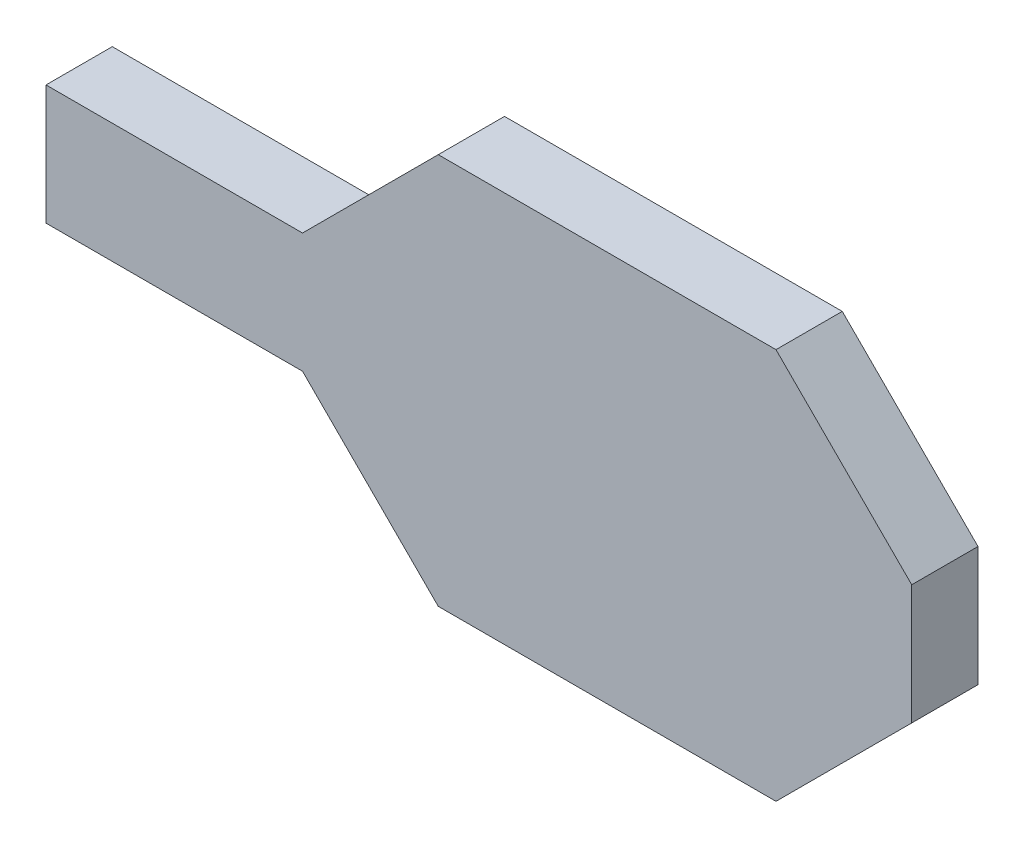
ISO-10303-21;
HEADER;
FILE_DESCRIPTION(('STEP AP214'),'2;1');
FILE_NAME('part.step','',(''),(''),'','','');
FILE_SCHEMA(('AUTOMOTIVE_DESIGN { 1 0 10303 214 1 1 1 1 }'));
ENDSEC;
DATA;
#1=APPLICATION_CONTEXT('core data for automotive mechanical design processes');
#2=APPLICATION_PROTOCOL_DEFINITION('international standard','automotive_design',2000,#1);
#3=PRODUCT_CONTEXT('',#1,'mechanical');
#4=PRODUCT('Part','Part','',(#3));
#5=PRODUCT_RELATED_PRODUCT_CATEGORY('part','',(#4));
#6=PRODUCT_DEFINITION_FORMATION('','',#4);
#7=PRODUCT_DEFINITION_CONTEXT('part definition',#1,'design');
#8=PRODUCT_DEFINITION('design','',#6,#7);
#9=PRODUCT_DEFINITION_SHAPE('','',#8);
#10=(LENGTH_UNIT() NAMED_UNIT(*) SI_UNIT(.MILLI.,.METRE.));
#11=(NAMED_UNIT(*) PLANE_ANGLE_UNIT() SI_UNIT($,.RADIAN.));
#12=(NAMED_UNIT(*) SI_UNIT($,.STERADIAN.) SOLID_ANGLE_UNIT());
#13=UNCERTAINTY_MEASURE_WITH_UNIT(LENGTH_MEASURE(1.E-05),#10,'distance_accuracy_value','');
#14=(GEOMETRIC_REPRESENTATION_CONTEXT(3) GLOBAL_UNCERTAINTY_ASSIGNED_CONTEXT((#13)) GLOBAL_UNIT_ASSIGNED_CONTEXT((#10,
#11,#12)) REPRESENTATION_CONTEXT('',''));
#15=CARTESIAN_POINT('',(0.,0.,0.));
#16=DIRECTION('',(0.,0.,1.));
#17=DIRECTION('',(1.,0.,0.));
#18=AXIS2_PLACEMENT_3D('',#15,#16,#17);
#19=CARTESIAN_POINT('',(-0.9,2.58,0.));
#20=DIRECTION('',(0.,-1.,0.));
#21=DIRECTION('',(1.,0.,0.));
#22=AXIS2_PLACEMENT_3D('',#19,#20,#21);
#23=PLANE('',#22);
#24=DIRECTION('',(0.,0.,1.));
#25=VECTOR('',#24,1.);
#26=CARTESIAN_POINT('',(0.3,2.58,0.));
#27=LINE('',#26,#25);
#28=CARTESIAN_POINT('',(0.3,2.58,0.31));
#29=VERTEX_POINT('',#28);
#30=CARTESIAN_POINT('',(0.3,2.58,0.));
#31=VERTEX_POINT('',#30);
#32=EDGE_CURVE('E121',#29,#31,#27,.F.);
#33=ORIENTED_EDGE('',*,*,#32,.T.);
#34=DIRECTION('',(1.,0.,0.));
#35=VECTOR('',#34,1.);
#36=CARTESIAN_POINT('',(-0.9,2.58,0.));
#37=LINE('',#36,#35);
#38=CARTESIAN_POINT('',(-0.9,2.58,0.));
#39=VERTEX_POINT('',#38);
#40=EDGE_CURVE('E110',#31,#39,#37,.F.);
#41=ORIENTED_EDGE('',*,*,#40,.T.);
#42=DIRECTION('',(0.,0.,1.));
#43=VECTOR('',#42,1.);
#44=CARTESIAN_POINT('',(-0.9,2.58,0.));
#45=LINE('',#44,#43);
#46=CARTESIAN_POINT('',(-0.9,2.58,0.31));
#47=VERTEX_POINT('',#46);
#48=EDGE_CURVE('E101',#39,#47,#45,.T.);
#49=ORIENTED_EDGE('',*,*,#48,.T.);
#50=DIRECTION('',(1.,0.,0.));
#51=VECTOR('',#50,1.);
#52=CARTESIAN_POINT('',(-0.9,2.58,0.31));
#53=LINE('',#52,#51);
#54=EDGE_CURVE('E20',#29,#47,#53,.F.);
#55=ORIENTED_EDGE('',*,*,#54,.F.);
#56=EDGE_LOOP('',(#33,#41,#49,#55));
#57=FACE_BOUND('',#56,.T.);
#58=ADVANCED_FACE('F17',(#57),#23,.F.);
#59=CARTESIAN_POINT('',(-0.9,2.58,0.));
#60=DIRECTION('',(1.,0.,0.));
#61=DIRECTION('',(0.,1.,0.));
#62=AXIS2_PLACEMENT_3D('',#59,#60,#61);
#63=PLANE('',#62);
#64=DIRECTION('',(0.,1.,0.));
#65=VECTOR('',#64,1.);
#66=CARTESIAN_POINT('',(-0.9,2.58,0.31));
#67=LINE('',#66,#65);
#68=CARTESIAN_POINT('',(-0.9,2.02,0.31));
#69=VERTEX_POINT('',#68);
#70=EDGE_CURVE('E91',#47,#69,#67,.F.);
#71=ORIENTED_EDGE('',*,*,#70,.F.);
#72=ORIENTED_EDGE('',*,*,#48,.F.);
#73=DIRECTION('',(0.,1.,0.));
#74=VECTOR('',#73,1.);
#75=CARTESIAN_POINT('',(-0.9,2.58,0.));
#76=LINE('',#75,#74);
#77=CARTESIAN_POINT('',(-0.9,2.02,0.));
#78=VERTEX_POINT('',#77);
#79=EDGE_CURVE('E124',#39,#78,#76,.F.);
#80=ORIENTED_EDGE('',*,*,#79,.T.);
#81=DIRECTION('',(0.,0.,1.));
#82=VECTOR('',#81,1.);
#83=CARTESIAN_POINT('',(-0.9,2.02,0.));
#84=LINE('',#83,#82);
#85=EDGE_CURVE('E107',#69,#78,#84,.F.);
#86=ORIENTED_EDGE('',*,*,#85,.F.);
#87=EDGE_LOOP('',(#71,#72,#80,#86));
#88=FACE_BOUND('',#87,.T.);
#89=ADVANCED_FACE('F104',(#88),#63,.F.);
#90=CARTESIAN_POINT('',(-0.9,2.02,0.));
#91=DIRECTION('',(0.,-1.,0.));
#92=DIRECTION('',(1.,0.,0.));
#93=AXIS2_PLACEMENT_3D('',#90,#91,#92);
#94=PLANE('',#93);
#95=DIRECTION('',(0.,0.,1.));
#96=VECTOR('',#95,1.);
#97=CARTESIAN_POINT('',(0.3,2.02,0.));
#98=LINE('',#97,#96);
#99=CARTESIAN_POINT('',(0.3,2.02,0.));
#100=VERTEX_POINT('',#99);
#101=CARTESIAN_POINT('',(0.3,2.02,0.31));
#102=VERTEX_POINT('',#101);
#103=EDGE_CURVE('E129',#100,#102,#98,.T.);
#104=ORIENTED_EDGE('',*,*,#103,.T.);
#105=DIRECTION('',(1.,0.,0.));
#106=VECTOR('',#105,1.);
#107=CARTESIAN_POINT('',(-0.9,2.02,0.31));
#108=LINE('',#107,#106);
#109=EDGE_CURVE('E113',#102,#69,#108,.F.);
#110=ORIENTED_EDGE('',*,*,#109,.T.);
#111=ORIENTED_EDGE('',*,*,#85,.T.);
#112=DIRECTION('',(1.,0.,0.));
#113=VECTOR('',#112,1.);
#114=CARTESIAN_POINT('',(-0.9,2.02,0.));
#115=LINE('',#114,#113);
#116=EDGE_CURVE('E126',#78,#100,#115,.T.);
#117=ORIENTED_EDGE('',*,*,#116,.T.);
#118=EDGE_LOOP('',(#104,#110,#111,#117));
#119=FACE_BOUND('',#118,.T.);
#120=ADVANCED_FACE('F192',(#119),#94,.T.);
#121=CARTESIAN_POINT('',(0.3,3.215,0.31));
#122=DIRECTION('',(0.,0.,1.));
#123=DIRECTION('',(1.,0.,0.));
#124=AXIS2_PLACEMENT_3D('',#121,#122,#123);
#125=PLANE('',#124);
#126=DIRECTION('',(0.,1.,0.));
#127=VECTOR('',#126,1.);
#128=CARTESIAN_POINT('',(3.15,3.215,0.31));
#129=LINE('',#128,#127);
#130=CARTESIAN_POINT('',(3.15,2.58,0.31));
#131=VERTEX_POINT('',#130);
#132=CARTESIAN_POINT('',(3.15,2.02,0.31));
#133=VERTEX_POINT('',#132);
#134=EDGE_CURVE('E145',#131,#133,#129,.F.);
#135=ORIENTED_EDGE('',*,*,#134,.F.);
#136=DIRECTION('',(0.707106781186548,-0.707106781186548,0.));
#137=VECTOR('',#136,1.);
#138=CARTESIAN_POINT('',(3.15,2.58,0.31));
#139=LINE('',#138,#137);
#140=CARTESIAN_POINT('',(2.515,3.215,0.31));
#141=VERTEX_POINT('',#140);
#142=EDGE_CURVE('E150',#131,#141,#139,.F.);
#143=ORIENTED_EDGE('',*,*,#142,.T.);
#144=DIRECTION('',(1.,0.,0.));
#145=VECTOR('',#144,1.);
#146=CARTESIAN_POINT('',(0.3,3.215,0.31));
#147=LINE('',#146,#145);
#148=CARTESIAN_POINT('',(0.935,3.215,0.31));
#149=VERTEX_POINT('',#148);
#150=EDGE_CURVE('E115',#141,#149,#147,.F.);
#151=ORIENTED_EDGE('',*,*,#150,.T.);
#152=DIRECTION('',(0.707106781186548,0.707106781186548,0.));
#153=VECTOR('',#152,1.);
#154=CARTESIAN_POINT('',(0.935,3.215,0.31));
#155=LINE('',#154,#153);
#156=EDGE_CURVE('E96',#149,#29,#155,.F.);
#157=ORIENTED_EDGE('',*,*,#156,.T.);
#158=ORIENTED_EDGE('',*,*,#54,.T.);
#159=ORIENTED_EDGE('',*,*,#70,.T.);
#160=ORIENTED_EDGE('',*,*,#109,.F.);
#161=DIRECTION('',(-0.707106781186548,0.707106781186548,0.));
#162=VECTOR('',#161,1.);
#163=CARTESIAN_POINT('',(0.3,2.02,0.31));
#164=LINE('',#163,#162);
#165=CARTESIAN_POINT('',(0.935,1.385,0.31));
#166=VERTEX_POINT('',#165);
#167=EDGE_CURVE('E132',#102,#166,#164,.F.);
#168=ORIENTED_EDGE('',*,*,#167,.T.);
#169=DIRECTION('',(1.,0.,0.));
#170=VECTOR('',#169,1.);
#171=CARTESIAN_POINT('',(0.3,1.385,0.31));
#172=LINE('',#171,#170);
#173=CARTESIAN_POINT('',(2.515,1.385,0.31));
#174=VERTEX_POINT('',#173);
#175=EDGE_CURVE('E136',#174,#166,#172,.F.);
#176=ORIENTED_EDGE('',*,*,#175,.F.);
#177=DIRECTION('',(-0.707106781186548,-0.707106781186548,0.));
#178=VECTOR('',#177,1.);
#179=CARTESIAN_POINT('',(2.515,1.385,0.31));
#180=LINE('',#179,#178);
#181=EDGE_CURVE('E142',#174,#133,#180,.F.);
#182=ORIENTED_EDGE('',*,*,#181,.T.);
#183=EDGE_LOOP('',(#135,#143,#151,#157,#158,#159,#160,#168,#176,#182));
#184=FACE_BOUND('',#183,.T.);
#185=ADVANCED_FACE('F94',(#184),#125,.T.);
#186=CARTESIAN_POINT('',(0.3,3.215,0.));
#187=DIRECTION('',(0.,-1.,0.));
#188=DIRECTION('',(1.,0.,0.));
#189=AXIS2_PLACEMENT_3D('',#186,#187,#188);
#190=PLANE('',#189);
#191=DIRECTION('',(0.,0.,1.));
#192=VECTOR('',#191,1.);
#193=CARTESIAN_POINT('',(2.515,3.215,0.));
#194=LINE('',#193,#192);
#195=CARTESIAN_POINT('',(2.515,3.215,0.));
#196=VERTEX_POINT('',#195);
#197=EDGE_CURVE('E153',#141,#196,#194,.F.);
#198=ORIENTED_EDGE('',*,*,#197,.T.);
#199=DIRECTION('',(1.,0.,0.));
#200=VECTOR('',#199,1.);
#201=CARTESIAN_POINT('',(0.3,3.215,0.));
#202=LINE('',#201,#200);
#203=CARTESIAN_POINT('',(0.935,3.215,0.));
#204=VERTEX_POINT('',#203);
#205=EDGE_CURVE('E156',#196,#204,#202,.F.);
#206=ORIENTED_EDGE('',*,*,#205,.T.);
#207=DIRECTION('',(0.,0.,1.));
#208=VECTOR('',#207,1.);
#209=CARTESIAN_POINT('',(0.935,3.215,0.));
#210=LINE('',#209,#208);
#211=EDGE_CURVE('E117',#204,#149,#210,.T.);
#212=ORIENTED_EDGE('',*,*,#211,.T.);
#213=ORIENTED_EDGE('',*,*,#150,.F.);
#214=EDGE_LOOP('',(#198,#206,#212,#213));
#215=FACE_BOUND('',#214,.T.);
#216=ADVANCED_FACE('F197',(#215),#190,.F.);
#217=CARTESIAN_POINT('',(0.935,3.215,0.));
#218=DIRECTION('',(0.707106781186548,-0.707106781186548,0.));
#219=DIRECTION('',(0.707106781186548,0.707106781186548,0.));
#220=AXIS2_PLACEMENT_3D('',#217,#218,#219);
#221=PLANE('',#220);
#222=ORIENTED_EDGE('',*,*,#32,.F.);
#223=ORIENTED_EDGE('',*,*,#156,.F.);
#224=ORIENTED_EDGE('',*,*,#211,.F.);
#225=DIRECTION('',(-0.707106781186548,-0.707106781186547,0.));
#226=VECTOR('',#225,1.);
#227=CARTESIAN_POINT('',(0.935,3.215,0.));
#228=LINE('',#227,#226);
#229=EDGE_CURVE('E159',#204,#31,#228,.T.);
#230=ORIENTED_EDGE('',*,*,#229,.T.);
#231=EDGE_LOOP('',(#222,#223,#224,#230));
#232=FACE_BOUND('',#231,.T.);
#233=ADVANCED_FACE('F195',(#232),#221,.F.);
#234=CARTESIAN_POINT('',(0.3,2.02,0.));
#235=DIRECTION('',(0.707106781186548,0.707106781186548,0.));
#236=DIRECTION('',(-0.707106781186548,0.707106781186548,0.));
#237=AXIS2_PLACEMENT_3D('',#234,#235,#236);
#238=PLANE('',#237);
#239=DIRECTION('',(0.,0.,1.));
#240=VECTOR('',#239,1.);
#241=CARTESIAN_POINT('',(0.935,1.385,0.));
#242=LINE('',#241,#240);
#243=CARTESIAN_POINT('',(0.935,1.385,0.));
#244=VERTEX_POINT('',#243);
#245=EDGE_CURVE('E134',#166,#244,#242,.F.);
#246=ORIENTED_EDGE('',*,*,#245,.F.);
#247=ORIENTED_EDGE('',*,*,#167,.F.);
#248=ORIENTED_EDGE('',*,*,#103,.F.);
#249=DIRECTION('',(0.707106781186548,-0.707106781186548,0.));
#250=VECTOR('',#249,1.);
#251=CARTESIAN_POINT('',(0.3,2.02,0.));
#252=LINE('',#251,#250);
#253=EDGE_CURVE('E162',#100,#244,#252,.T.);
#254=ORIENTED_EDGE('',*,*,#253,.T.);
#255=EDGE_LOOP('',(#246,#247,#248,#254));
#256=FACE_BOUND('',#255,.T.);
#257=ADVANCED_FACE('F189',(#256),#238,.F.);
#258=CARTESIAN_POINT('',(0.3,1.385,0.));
#259=DIRECTION('',(0.,-1.,0.));
#260=DIRECTION('',(1.,0.,0.));
#261=AXIS2_PLACEMENT_3D('',#258,#259,#260);
#262=PLANE('',#261);
#263=DIRECTION('',(0.,0.,1.));
#264=VECTOR('',#263,1.);
#265=CARTESIAN_POINT('',(2.515,1.385,0.));
#266=LINE('',#265,#264);
#267=CARTESIAN_POINT('',(2.515,1.385,0.));
#268=VERTEX_POINT('',#267);
#269=EDGE_CURVE('E139',#268,#174,#266,.T.);
#270=ORIENTED_EDGE('',*,*,#269,.T.);
#271=ORIENTED_EDGE('',*,*,#175,.T.);
#272=ORIENTED_EDGE('',*,*,#245,.T.);
#273=DIRECTION('',(1.,0.,0.));
#274=VECTOR('',#273,1.);
#275=CARTESIAN_POINT('',(0.3,1.385,0.));
#276=LINE('',#275,#274);
#277=EDGE_CURVE('E165',#244,#268,#276,.T.);
#278=ORIENTED_EDGE('',*,*,#277,.T.);
#279=EDGE_LOOP('',(#270,#271,#272,#278));
#280=FACE_BOUND('',#279,.T.);
#281=ADVANCED_FACE('F184',(#280),#262,.T.);
#282=CARTESIAN_POINT('',(2.515,1.385,0.));
#283=DIRECTION('',(-0.707106781186548,0.707106781186548,0.));
#284=DIRECTION('',(-0.707106781186548,-0.707106781186548,0.));
#285=AXIS2_PLACEMENT_3D('',#282,#283,#284);
#286=PLANE('',#285);
#287=DIRECTION('',(0.,0.,1.));
#288=VECTOR('',#287,1.);
#289=CARTESIAN_POINT('',(3.15,2.02,0.));
#290=LINE('',#289,#288);
#291=CARTESIAN_POINT('',(3.15,2.02,0.));
#292=VERTEX_POINT('',#291);
#293=EDGE_CURVE('E147',#133,#292,#290,.F.);
#294=ORIENTED_EDGE('',*,*,#293,.F.);
#295=ORIENTED_EDGE('',*,*,#181,.F.);
#296=ORIENTED_EDGE('',*,*,#269,.F.);
#297=DIRECTION('',(0.707106781186547,0.707106781186548,0.));
#298=VECTOR('',#297,1.);
#299=CARTESIAN_POINT('',(2.515,1.385,0.));
#300=LINE('',#299,#298);
#301=EDGE_CURVE('E168',#268,#292,#300,.T.);
#302=ORIENTED_EDGE('',*,*,#301,.T.);
#303=EDGE_LOOP('',(#294,#295,#296,#302));
#304=FACE_BOUND('',#303,.T.);
#305=ADVANCED_FACE('F181',(#304),#286,.F.);
#306=CARTESIAN_POINT('',(3.15,3.215,0.));
#307=DIRECTION('',(1.,0.,0.));
#308=DIRECTION('',(0.,1.,0.));
#309=AXIS2_PLACEMENT_3D('',#306,#307,#308);
#310=PLANE('',#309);
#311=ORIENTED_EDGE('',*,*,#134,.T.);
#312=ORIENTED_EDGE('',*,*,#293,.T.);
#313=DIRECTION('',(0.,1.,0.));
#314=VECTOR('',#313,1.);
#315=CARTESIAN_POINT('',(3.15,3.215,0.));
#316=LINE('',#315,#314);
#317=CARTESIAN_POINT('',(3.15,2.58,0.));
#318=VERTEX_POINT('',#317);
#319=EDGE_CURVE('E26',#292,#318,#316,.T.);
#320=ORIENTED_EDGE('',*,*,#319,.T.);
#321=DIRECTION('',(0.,0.,1.));
#322=VECTOR('',#321,1.);
#323=CARTESIAN_POINT('',(3.15,2.58,0.));
#324=LINE('',#323,#322);
#325=EDGE_CURVE('E34',#318,#131,#324,.T.);
#326=ORIENTED_EDGE('',*,*,#325,.T.);
#327=EDGE_LOOP('',(#311,#312,#320,#326));
#328=FACE_BOUND('',#327,.T.);
#329=ADVANCED_FACE('F174',(#328),#310,.T.);
#330=CARTESIAN_POINT('',(3.15,2.58,0.));
#331=DIRECTION('',(-0.707106781186548,-0.707106781186548,0.));
#332=DIRECTION('',(0.707106781186548,-0.707106781186548,0.));
#333=AXIS2_PLACEMENT_3D('',#330,#331,#332);
#334=PLANE('',#333);
#335=ORIENTED_EDGE('',*,*,#197,.F.);
#336=ORIENTED_EDGE('',*,*,#142,.F.);
#337=ORIENTED_EDGE('',*,*,#325,.F.);
#338=DIRECTION('',(-0.707106781186547,0.707106781186547,0.));
#339=VECTOR('',#338,1.);
#340=CARTESIAN_POINT('',(3.15,2.58,0.));
#341=LINE('',#340,#339);
#342=EDGE_CURVE('E11',#318,#196,#341,.T.);
#343=ORIENTED_EDGE('',*,*,#342,.T.);
#344=EDGE_LOOP('',(#335,#336,#337,#343));
#345=FACE_BOUND('',#344,.T.);
#346=ADVANCED_FACE('F199',(#345),#334,.F.);
#347=CARTESIAN_POINT('',(0.3,3.215,0.));
#348=DIRECTION('',(0.,0.,1.));
#349=DIRECTION('',(1.,0.,0.));
#350=AXIS2_PLACEMENT_3D('',#347,#348,#349);
#351=PLANE('',#350);
#352=ORIENTED_EDGE('',*,*,#319,.F.);
#353=ORIENTED_EDGE('',*,*,#301,.F.);
#354=ORIENTED_EDGE('',*,*,#277,.F.);
#355=ORIENTED_EDGE('',*,*,#253,.F.);
#356=ORIENTED_EDGE('',*,*,#116,.F.);
#357=ORIENTED_EDGE('',*,*,#79,.F.);
#358=ORIENTED_EDGE('',*,*,#40,.F.);
#359=ORIENTED_EDGE('',*,*,#229,.F.);
#360=ORIENTED_EDGE('',*,*,#205,.F.);
#361=ORIENTED_EDGE('',*,*,#342,.F.);
#362=EDGE_LOOP('',(#352,#353,#354,#355,#356,#357,#358,#359,#360,#361));
#363=FACE_BOUND('',#362,.T.);
#364=ADVANCED_FACE('F178',(#363),#351,.F.);
#365=CLOSED_SHELL('',(#58,#89,#120,#185,#216,#233,#257,#281,#305,#329,#346,#364));
#366=MANIFOLD_SOLID_BREP('B1',#365);
#367=ADVANCED_BREP_SHAPE_REPRESENTATION('',(#18,#366),#14);
#368=SHAPE_DEFINITION_REPRESENTATION(#9,#367);
ENDSEC;
END-ISO-10303-21;
